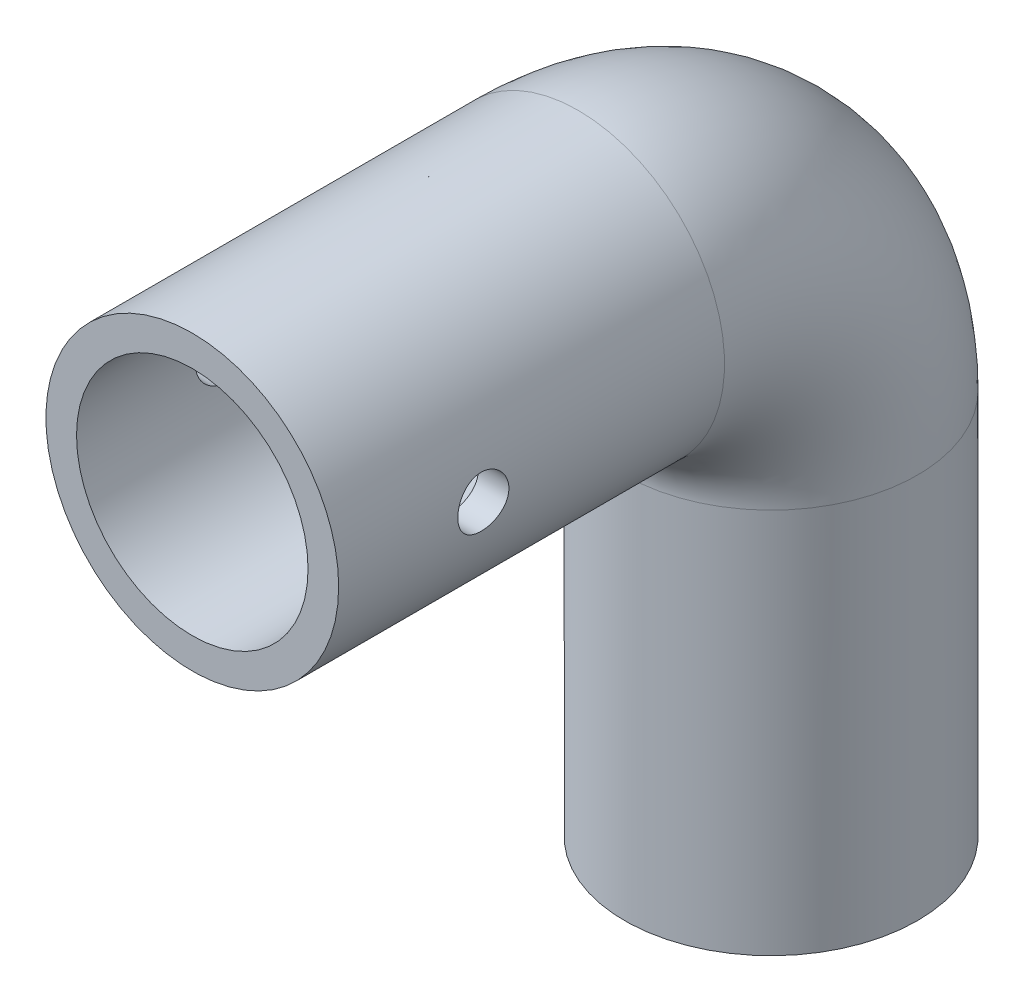
ISO-10303-21;
HEADER;
FILE_DESCRIPTION(('STEP AP214'),'2;1');
FILE_NAME('part.step','',(''),(''),'','','');
FILE_SCHEMA(('AUTOMOTIVE_DESIGN { 1 0 10303 214 1 1 1 1 }'));
ENDSEC;
DATA;
#1=APPLICATION_CONTEXT('core data for automotive mechanical design processes');
#2=APPLICATION_PROTOCOL_DEFINITION('international standard','automotive_design',2000,#1);
#3=PRODUCT_CONTEXT('',#1,'mechanical');
#4=PRODUCT('Part','Part','',(#3));
#5=PRODUCT_RELATED_PRODUCT_CATEGORY('part','',(#4));
#6=PRODUCT_DEFINITION_FORMATION('','',#4);
#7=PRODUCT_DEFINITION_CONTEXT('part definition',#1,'design');
#8=PRODUCT_DEFINITION('design','',#6,#7);
#9=PRODUCT_DEFINITION_SHAPE('','',#8);
#10=(LENGTH_UNIT() NAMED_UNIT(*) SI_UNIT(.MILLI.,.METRE.));
#11=(NAMED_UNIT(*) PLANE_ANGLE_UNIT() SI_UNIT($,.RADIAN.));
#12=(NAMED_UNIT(*) SI_UNIT($,.STERADIAN.) SOLID_ANGLE_UNIT());
#13=UNCERTAINTY_MEASURE_WITH_UNIT(LENGTH_MEASURE(1.E-05),#10,'distance_accuracy_value','');
#14=(GEOMETRIC_REPRESENTATION_CONTEXT(3) GLOBAL_UNCERTAINTY_ASSIGNED_CONTEXT((#13)) GLOBAL_UNIT_ASSIGNED_CONTEXT((#10,
#11,#12)) REPRESENTATION_CONTEXT('',''));
#15=CARTESIAN_POINT('',(0.,0.,0.));
#16=DIRECTION('',(0.,0.,1.));
#17=DIRECTION('',(1.,0.,0.));
#18=AXIS2_PLACEMENT_3D('',#15,#16,#17);
#19=CARTESIAN_POINT('',(0.,0.,0.));
#20=DIRECTION('',(0.,0.,-1.));
#21=DIRECTION('',(-1.,0.,0.));
#22=AXIS2_PLACEMENT_3D('',#19,#20,#21);
#23=CYLINDRICAL_SURFACE('',#22,15.175);
#24=CARTESIAN_POINT('',(-15.175,0.,-17.65));
#25=CARTESIAN_POINT('',(-15.1749974064039,0.147648243844478,-17.6499941766016));
#26=CARTESIAN_POINT('',(-15.1728227661229,0.2953744315329,-17.6376186837428));
#27=CARTESIAN_POINT('',(-15.1643571715427,0.586676318693331,-17.58846843069));
#28=CARTESIAN_POINT('',(-15.1580625468,0.730248197936956,-17.5516719136973));
#29=CARTESIAN_POINT('',(-15.1420623123558,1.00898540411133,-17.4548305083773));
#30=CARTESIAN_POINT('',(-15.1323596012453,1.1441577602516,-17.3948053716848));
#31=CARTESIAN_POINT('',(-15.1106073289541,1.40249715445609,-17.2532639849897));
#32=CARTESIAN_POINT('',(-15.0985580070589,1.52566541466684,-17.1717499259286));
#33=CARTESIAN_POINT('',(-15.073305284455,1.7578033444615,-16.9886388513783));
#34=CARTESIAN_POINT('',(-15.0600921378452,1.86662933589699,-16.8868610136287));
#35=CARTESIAN_POINT('',(-15.0340747214544,2.06575175740715,-16.6665006253358));
#36=CARTESIAN_POINT('',(-15.021270478798,2.15604696039513,-16.5479169628093));
#37=CARTESIAN_POINT('',(-14.9974261395803,2.31612856856196,-16.296313515786));
#38=CARTESIAN_POINT('',(-14.9863986276067,2.38577137986726,-16.1632010732754));
#39=CARTESIAN_POINT('',(-14.9674923713733,2.50165269116626,-15.8869418365056));
#40=CARTESIAN_POINT('',(-14.959613392944,2.54789293177329,-15.7437957894179));
#41=CARTESIAN_POINT('',(-14.9479937381197,2.61520067315822,-15.4530612262915));
#42=CARTESIAN_POINT('',(-14.9442121540137,2.63651718140411,-15.3055320241791));
#43=CARTESIAN_POINT('',(-14.9410918699985,2.65414472958903,-15.0089461850617));
#44=CARTESIAN_POINT('',(-14.9417528248761,2.65045771245853,-14.8598896676374));
#45=CARTESIAN_POINT('',(-14.9474056272389,2.61838535739447,-14.5662676085279));
#46=CARTESIAN_POINT('',(-14.9523482028749,2.59028099755878,-14.4216702881913));
#47=CARTESIAN_POINT('',(-14.9659301203762,2.5106132582377,-14.1392752335586));
#48=CARTESIAN_POINT('',(-14.9745696002876,2.45904900273164,-14.0014777533898));
#49=CARTESIAN_POINT('',(-14.9946244679725,2.33364405992106,-13.7357598164403));
#50=CARTESIAN_POINT('',(-15.0060541855088,2.25968788814212,-13.6078949883433));
#51=CARTESIAN_POINT('',(-15.0303919199376,2.09168032934689,-13.3662836956274));
#52=CARTESIAN_POINT('',(-15.0433000674734,1.99762716579763,-13.2525384805596));
#53=CARTESIAN_POINT('',(-15.069356080034,1.79057043317531,-13.0407698803997));
#54=CARTESIAN_POINT('',(-15.0825048144791,1.67732605857837,-12.9429818971667));
#55=CARTESIAN_POINT('',(-15.1073982055927,1.43591271250156,-12.7677589180498));
#56=CARTESIAN_POINT('',(-15.1191428514944,1.30774362659296,-12.6903240782296));
#57=CARTESIAN_POINT('',(-15.1399239172846,1.03988885242209,-12.5579791974993));
#58=CARTESIAN_POINT('',(-15.1489576712667,0.900191998651237,-12.5030913099547));
#59=CARTESIAN_POINT('',(-15.1632780202203,0.613369163320422,-12.4176240347171));
#60=CARTESIAN_POINT('',(-15.1685649597426,0.466243866201081,-12.387042411829));
#61=CARTESIAN_POINT('',(-15.1747492875093,0.170768059957225,-12.3513780266997));
#62=CARTESIAN_POINT('',(-15.1757022626835,0.0224576523055133,-12.34597233899));
#63=CARTESIAN_POINT('',(-15.1732640150868,-0.272948911422718,-12.359950392095));
#64=CARTESIAN_POINT('',(-15.1698729764326,-0.420045118695999,-12.3793330822782));
#65=CARTESIAN_POINT('',(-15.1591622039047,-0.707840405361593,-12.4420691174099));
#66=CARTESIAN_POINT('',(-15.1518688958912,-0.848575688189006,-12.4852612853293));
#67=CARTESIAN_POINT('',(-15.1341679808123,-1.1208075424358,-12.5942174321889));
#68=CARTESIAN_POINT('',(-15.1237601849362,-1.25230355314214,-12.6599827796275));
#69=CARTESIAN_POINT('',(-15.1008464771594,-1.50371784874993,-12.8129488506752));
#70=CARTESIAN_POINT('',(-15.0883213467356,-1.62351260283844,-12.9003496733286));
#71=CARTESIAN_POINT('',(-15.0626169389685,-1.84685056306635,-13.0938321209533));
#72=CARTESIAN_POINT('',(-15.0494376092101,-1.95039246423561,-13.1999152445099));
#73=CARTESIAN_POINT('',(-15.0237287153678,-2.13949371183536,-13.4292044770167));
#74=CARTESIAN_POINT('',(-15.011208297492,-2.22483404234861,-13.5525924049802));
#75=CARTESIAN_POINT('',(-14.9884104086226,-2.3735762816681,-13.8121424295855));
#76=CARTESIAN_POINT('',(-14.9781328616795,-2.43697893338481,-13.9483040934514));
#77=CARTESIAN_POINT('',(-14.9610541786933,-2.53972471940061,-14.2289449050297));
#78=CARTESIAN_POINT('',(-14.9542377741183,-2.57917367707349,-14.3733843378983));
#79=CARTESIAN_POINT('',(-14.9448160737523,-2.63322299429685,-14.6669694037372));
#80=CARTESIAN_POINT('',(-14.9422103722277,-2.647825747977,-14.8161145818607));
#81=CARTESIAN_POINT('',(-14.9415237489158,-2.65169640615764,-15.1126880481571));
#82=CARTESIAN_POINT('',(-14.943381212065,-2.64130929920643,-15.2601118035601));
#83=CARTESIAN_POINT('',(-14.9512760064122,-2.59624450353386,-15.5510787803424));
#84=CARTESIAN_POINT('',(-14.9573133200989,-2.56156691657599,-15.6946220179763));
#85=CARTESIAN_POINT('',(-14.9728632028595,-2.46904272437462,-15.9736005914648));
#86=CARTESIAN_POINT('',(-14.9823708893835,-2.4112286594292,-16.1090470088625));
#87=CARTESIAN_POINT('',(-15.0037944611049,-2.2741088522703,-16.3683735048738));
#88=CARTESIAN_POINT('',(-15.0157104847189,-2.19480187468397,-16.492252918087));
#89=CARTESIAN_POINT('',(-15.0408019466779,-2.01572793006059,-16.7266665275475));
#90=CARTESIAN_POINT('',(-15.0539917565902,-1.91570813445559,-16.8370060737835));
#91=CARTESIAN_POINT('',(-15.0800326762498,-1.69857899715446,-17.0394521719192));
#92=CARTESIAN_POINT('',(-15.0928837073212,-1.58146572634864,-17.1315545203113));
#93=CARTESIAN_POINT('',(-15.1169137634344,-1.33240411753729,-17.2955623631435));
#94=CARTESIAN_POINT('',(-15.128079226934,-1.20034901506857,-17.3673077462842));
#95=CARTESIAN_POINT('',(-15.1473481252041,-0.925915032353569,-17.4874838317986));
#96=CARTESIAN_POINT('',(-15.1554545443977,-0.783546376596997,-17.5359372706497));
#97=CARTESIAN_POINT('',(-15.165965546675,-0.533893508538533,-17.5978856790505));
#98=CARTESIAN_POINT('',(-15.1693349842757,-0.428101844795429,-17.6173964881246));
#99=CARTESIAN_POINT('',(-15.1738531325651,-0.214887195826175,-17.6434556380678));
#100=CARTESIAN_POINT('',(-15.175001887722,-0.107464243309344,-17.6500042385001));
#101=CARTESIAN_POINT('',(-15.175,0.,-17.65));
#102=B_SPLINE_CURVE_WITH_KNOTS('',3,(#24,#25,#26,#27,#28,#29,#30,#31,#32,#33,#34,#35,#36,#37,
#38,#39,#40,#41,#42,#43,#44,#45,#46,#47,#48,#49,#50,#51,#52,#53,#54,#55,#56,#57,#58,#59,#60,#61,
#62,#63,#64,#65,#66,#67,#68,#69,#70,#71,#72,#73,#74,#75,#76,#77,#78,#79,#80,#81,#82,#83,#84,#85,
#86,#87,#88,#89,#90,#91,#92,#93,#94,#95,#96,#97,#98,#99,#100,#101),.UNSPECIFIED.,.T.,.F.,(4,2,2,
2,2,2,2,2,2,2,2,2,2,2,2,2,2,2,2,2,2,2,2,2,2,2,2,2,2,2,2,2,2,2,2,2,2,2,4),(0.,0.442551849632869,
0.885498500881895,1.32806933280104,1.77059505906007,2.21726252093644,2.66395955106177,
3.11369327427877,3.56339354272665,4.00856149002922,4.4536948453915,4.89377275456771,
5.33386709813041,5.77627101464181,6.2187140549453,6.66718717273105,7.1156637292162,
7.56457988555955,8.01345475495685,8.45655586387527,8.89963819300496,9.33975729147715,
9.77990307687219,10.2242825615179,10.6686977079431,11.1181913859245,11.5676698404974,
12.0151478471178,12.4625827332253,12.9038762427145,13.3451679034426,13.7858410786367,
14.2265395882838,14.6729732052611,15.1195096016409,15.5694664510616,16.018983177778,
16.3410964029433,16.6632031778538),.UNSPECIFIED.);
#103=CARTESIAN_POINT('',(-15.175,0.,-17.65));
#104=VERTEX_POINT('',#103);
#105=EDGE_CURVE('E10',#104,#104,#102,.T.);
#106=ORIENTED_EDGE('',*,*,#105,.T.);
#107=EDGE_LOOP('',(#106));
#108=FACE_BOUND('',#107,.T.);
#109=CARTESIAN_POINT('',(15.175,0.,-12.35));
#110=CARTESIAN_POINT('',(15.1749974064039,0.147648243844478,-12.3500058233984));
#111=CARTESIAN_POINT('',(15.1728227661229,0.2953744315329,-12.3623813162572));
#112=CARTESIAN_POINT('',(15.1643571715427,0.586676318693332,-12.41153156931));
#113=CARTESIAN_POINT('',(15.1580625468,0.730248197936956,-12.4483280863027));
#114=CARTESIAN_POINT('',(15.1420623123558,1.00898540411133,-12.5451694916227));
#115=CARTESIAN_POINT('',(15.1323596012453,1.1441577602516,-12.6051946283152));
#116=CARTESIAN_POINT('',(15.1106073289541,1.40249715445609,-12.7467360150103));
#117=CARTESIAN_POINT('',(15.0985580070589,1.52566541466684,-12.8282500740714));
#118=CARTESIAN_POINT('',(15.073305284455,1.7578033444615,-13.0113611486217));
#119=CARTESIAN_POINT('',(15.0600921378452,1.86662933589699,-13.1131389863713));
#120=CARTESIAN_POINT('',(15.0340747214544,2.06575175740715,-13.3334993746642));
#121=CARTESIAN_POINT('',(15.021270478798,2.15604696039513,-13.4520830371907));
#122=CARTESIAN_POINT('',(14.9974261395803,2.31612856856196,-13.703686484214));
#123=CARTESIAN_POINT('',(14.9863986276067,2.38577137986726,-13.8367989267246));
#124=CARTESIAN_POINT('',(14.9674923713733,2.50165269116626,-14.1130581634944));
#125=CARTESIAN_POINT('',(14.959613392944,2.54789293177329,-14.2562042105821));
#126=CARTESIAN_POINT('',(14.9479937381197,2.61520067315822,-14.5469387737085));
#127=CARTESIAN_POINT('',(14.9442121540137,2.63651718140411,-14.6944679758209));
#128=CARTESIAN_POINT('',(14.9410918699985,2.65414472958903,-14.9910538149383));
#129=CARTESIAN_POINT('',(14.9417528248761,2.65045771245853,-15.1401103323626));
#130=CARTESIAN_POINT('',(14.9474056272389,2.61838535739447,-15.4337323914721));
#131=CARTESIAN_POINT('',(14.9523482028749,2.59028099755878,-15.5783297118087));
#132=CARTESIAN_POINT('',(14.9659301203762,2.5106132582377,-15.8607247664414));
#133=CARTESIAN_POINT('',(14.9745696002876,2.45904900273164,-15.9985222466102));
#134=CARTESIAN_POINT('',(14.9946244679725,2.33364405992106,-16.2642401835597));
#135=CARTESIAN_POINT('',(15.0060541855088,2.25968788814212,-16.3921050116567));
#136=CARTESIAN_POINT('',(15.0303919199376,2.09168032934689,-16.6337163043726));
#137=CARTESIAN_POINT('',(15.0433000674734,1.99762716579763,-16.7474615194404));
#138=CARTESIAN_POINT('',(15.069356080034,1.79057043317531,-16.9592301196003));
#139=CARTESIAN_POINT('',(15.0825048144791,1.67732605857837,-17.0570181028333));
#140=CARTESIAN_POINT('',(15.1073982055927,1.43591271250156,-17.2322410819502));
#141=CARTESIAN_POINT('',(15.1191428514944,1.30774362659296,-17.3096759217704));
#142=CARTESIAN_POINT('',(15.1399239172846,1.0398888524221,-17.4420208025007));
#143=CARTESIAN_POINT('',(15.1489576712667,0.900191998651237,-17.4969086900453));
#144=CARTESIAN_POINT('',(15.1632780202203,0.613369163320422,-17.5823759652828));
#145=CARTESIAN_POINT('',(15.1685649597426,0.466243866201081,-17.612957588171));
#146=CARTESIAN_POINT('',(15.1747492875093,0.170768059957225,-17.6486219733003));
#147=CARTESIAN_POINT('',(15.1757022626835,0.0224576523055125,-17.65402766101));
#148=CARTESIAN_POINT('',(15.1732640150868,-0.272948911422719,-17.640049607905));
#149=CARTESIAN_POINT('',(15.1698729764326,-0.420045118696001,-17.6206669177218));
#150=CARTESIAN_POINT('',(15.1591622039047,-0.707840405361594,-17.5579308825901));
#151=CARTESIAN_POINT('',(15.1518688958912,-0.848575688189007,-17.5147387146707));
#152=CARTESIAN_POINT('',(15.1341679808123,-1.1208075424358,-17.4057825678111));
#153=CARTESIAN_POINT('',(15.1237601849362,-1.25230355314214,-17.3400172203725));
#154=CARTESIAN_POINT('',(15.1008464771594,-1.50371784874993,-17.1870511493248));
#155=CARTESIAN_POINT('',(15.0883213467356,-1.62351260283844,-17.0996503266714));
#156=CARTESIAN_POINT('',(15.0626169389685,-1.84685056306635,-16.9061678790467));
#157=CARTESIAN_POINT('',(15.0494376092101,-1.95039246423561,-16.8000847554901));
#158=CARTESIAN_POINT('',(15.0237287153678,-2.13949371183536,-16.5707955229833));
#159=CARTESIAN_POINT('',(15.011208297492,-2.22483404234861,-16.4474075950198));
#160=CARTESIAN_POINT('',(14.9884104086226,-2.3735762816681,-16.1878575704145));
#161=CARTESIAN_POINT('',(14.9781328616795,-2.43697893338481,-16.0516959065486));
#162=CARTESIAN_POINT('',(14.9610541786933,-2.53972471940061,-15.7710550949703));
#163=CARTESIAN_POINT('',(14.9542377741183,-2.57917367707349,-15.6266156621017));
#164=CARTESIAN_POINT('',(14.9448160737523,-2.63322299429685,-15.3330305962628));
#165=CARTESIAN_POINT('',(14.9422103722277,-2.647825747977,-15.1838854181393));
#166=CARTESIAN_POINT('',(14.9415237489158,-2.65169640615764,-14.8873119518429));
#167=CARTESIAN_POINT('',(14.943381212065,-2.64130929920643,-14.7398881964399));
#168=CARTESIAN_POINT('',(14.9512760064122,-2.59624450353386,-14.4489212196576));
#169=CARTESIAN_POINT('',(14.9573133200989,-2.56156691657599,-14.3053779820237));
#170=CARTESIAN_POINT('',(14.9728632028595,-2.46904272437462,-14.0263994085352));
#171=CARTESIAN_POINT('',(14.9823708893835,-2.4112286594292,-13.8909529911375));
#172=CARTESIAN_POINT('',(15.0037944611049,-2.2741088522703,-13.6316264951262));
#173=CARTESIAN_POINT('',(15.0157104847189,-2.19480187468396,-13.507747081913));
#174=CARTESIAN_POINT('',(15.0408019466779,-2.01572793006058,-13.2733334724525));
#175=CARTESIAN_POINT('',(15.0539917565902,-1.91570813445559,-13.1629939262165));
#176=CARTESIAN_POINT('',(15.0800326762498,-1.69857899715446,-12.9605478280808));
#177=CARTESIAN_POINT('',(15.0928837073212,-1.58146572634864,-12.8684454796887));
#178=CARTESIAN_POINT('',(15.1169137634344,-1.33240411753728,-12.7044376368565));
#179=CARTESIAN_POINT('',(15.128079226934,-1.20034901506857,-12.6326922537158));
#180=CARTESIAN_POINT('',(15.1473481252041,-0.925915032353567,-12.5125161682014));
#181=CARTESIAN_POINT('',(15.1554545443977,-0.783546376596995,-12.4640627293503));
#182=CARTESIAN_POINT('',(15.165965546675,-0.533893508538533,-12.4021143209495));
#183=CARTESIAN_POINT('',(15.1693349842757,-0.428101844795429,-12.3826035118754));
#184=CARTESIAN_POINT('',(15.1738531325651,-0.214887195826176,-12.3565443619322));
#185=CARTESIAN_POINT('',(15.175001887722,-0.107464243309344,-12.3499957614999));
#186=CARTESIAN_POINT('',(15.175,0.,-12.35));
#187=B_SPLINE_CURVE_WITH_KNOTS('',3,(#109,#110,#111,#112,#113,#114,#115,#116,#117,#118,#119,
#120,#121,#122,#123,#124,#125,#126,#127,#128,#129,#130,#131,#132,#133,#134,#135,#136,#137,#138,
#139,#140,#141,#142,#143,#144,#145,#146,#147,#148,#149,#150,#151,#152,#153,#154,#155,#156,#157,
#158,#159,#160,#161,#162,#163,#164,#165,#166,#167,#168,#169,#170,#171,#172,#173,#174,#175,#176,
#177,#178,#179,#180,#181,#182,#183,#184,#185,#186),.UNSPECIFIED.,.T.,.F.,(4,2,2,2,2,2,2,2,2,2,2,
2,2,2,2,2,2,2,2,2,2,2,2,2,2,2,2,2,2,2,2,2,2,2,2,2,2,2,4),(0.,0.442551849632869,
0.885498500881895,1.32806933280104,1.77059505906007,2.21726252093644,2.66395955106177,
3.11369327427877,3.56339354272665,4.00856149002922,4.4536948453915,4.89377275456771,
5.33386709813041,5.77627101464182,6.21871405494531,6.66718717273105,7.1156637292162,
7.56457988555955,8.01345475495685,8.45655586387527,8.89963819300496,9.33975729147715,
9.77990307687219,10.2242825615179,10.6686977079431,11.1181913859245,11.5676698404974,
12.0151478471178,12.4625827332253,12.9038762427145,13.3451679034426,13.7858410786367,
14.2265395882838,14.6729732052611,15.1195096016409,15.5694664510616,16.018983177778,
16.3410964029433,16.6632031778538),.UNSPECIFIED.);
#188=CARTESIAN_POINT('',(15.175,0.,-12.35));
#189=VERTEX_POINT('',#188);
#190=EDGE_CURVE('E49',#189,#189,#187,.T.);
#191=ORIENTED_EDGE('',*,*,#190,.T.);
#192=EDGE_LOOP('',(#191));
#193=FACE_BOUND('',#192,.T.);
#194=CARTESIAN_POINT('',(0.,0.,-40.));
#195=DIRECTION('',(0.,0.,1.));
#196=DIRECTION('',(1.,0.,0.));
#197=AXIS2_PLACEMENT_3D('',#194,#195,#196);
#198=CIRCLE('',#197,15.175);
#199=CARTESIAN_POINT('',(0.,15.175,-40.));
#200=VERTEX_POINT('',#199);
#201=EDGE_CURVE('E93',#200,#200,#198,.T.);
#202=ORIENTED_EDGE('',*,*,#201,.T.);
#203=EDGE_LOOP('',(#202));
#204=FACE_BOUND('',#203,.T.);
#205=CARTESIAN_POINT('',(0.,0.,0.));
#206=DIRECTION('',(0.,0.,1.));
#207=DIRECTION('',(1.,0.,0.));
#208=AXIS2_PLACEMENT_3D('',#205,#206,#207);
#209=CIRCLE('',#208,15.175);
#210=CARTESIAN_POINT('',(15.175,0.,0.));
#211=VERTEX_POINT('',#210);
#212=EDGE_CURVE('E113',#211,#211,#209,.T.);
#213=ORIENTED_EDGE('',*,*,#212,.F.);
#214=EDGE_LOOP('',(#213));
#215=FACE_BOUND('',#214,.T.);
#216=ADVANCED_FACE('F36',(#108,#193,#204,#215),#23,.T.);
#217=CARTESIAN_POINT('',(0.,-20.,-40.));
#218=DIRECTION('',(-1.,0.,0.));
#219=DIRECTION('',(0.,0.,1.));
#220=AXIS2_PLACEMENT_3D('',#217,#218,#219);
#221=TOROIDAL_SURFACE('',#220,20.,15.175);
#222=CARTESIAN_POINT('',(0.,-20.,-60.));
#223=DIRECTION('',(0.,1.,0.));
#224=DIRECTION('',(1.,0.,0.));
#225=AXIS2_PLACEMENT_3D('',#222,#223,#224);
#226=CIRCLE('',#225,15.175);
#227=CARTESIAN_POINT('',(0.,-20.,-75.175));
#228=VERTEX_POINT('',#227);
#229=EDGE_CURVE('E68',#228,#228,#226,.T.);
#230=CARTESIAN_POINT('',(0.,-20.,-40.));
#231=DIRECTION('',(-1.,0.,0.));
#232=DIRECTION('',(0.,0.,1.));
#233=AXIS2_PLACEMENT_3D('',#230,#231,#232);
#234=CIRCLE('',#233,35.175);
#235=EDGE_CURVE('',#200,#228,#234,.T.);
#236=ORIENTED_EDGE('',*,*,#201,.F.);
#237=ORIENTED_EDGE('',*,*,#229,.T.);
#238=ORIENTED_EDGE('',*,*,#235,.T.);
#239=ORIENTED_EDGE('',*,*,#235,.F.);
#240=EDGE_LOOP('',(#236,#238,#237,#239));
#241=FACE_BOUND('',#240,.T.);
#242=ADVANCED_FACE('F126',(#241),#221,.T.);
#243=CARTESIAN_POINT('',(0.,-20.,-60.));
#244=DIRECTION('',(0.,-1.,0.));
#245=DIRECTION('',(0.,0.,-1.));
#246=AXIS2_PLACEMENT_3D('',#243,#244,#245);
#247=CYLINDRICAL_SURFACE('',#246,15.175);
#248=CARTESIAN_POINT('',(0.,-60.,-60.));
#249=DIRECTION('',(0.,1.,0.));
#250=DIRECTION('',(1.,0.,0.));
#251=AXIS2_PLACEMENT_3D('',#248,#249,#250);
#252=CIRCLE('',#251,15.175);
#253=CARTESIAN_POINT('',(15.175,-60.,-60.));
#254=VERTEX_POINT('',#253);
#255=EDGE_CURVE('E103',#254,#254,#252,.T.);
#256=ORIENTED_EDGE('',*,*,#255,.T.);
#257=EDGE_LOOP('',(#256));
#258=FACE_BOUND('',#257,.T.);
#259=ORIENTED_EDGE('',*,*,#229,.F.);
#260=EDGE_LOOP('',(#259));
#261=FACE_BOUND('',#260,.T.);
#262=ADVANCED_FACE('F38',(#258,#261),#247,.T.);
#263=CARTESIAN_POINT('',(0.,0.,0.));
#264=DIRECTION('',(0.,0.,1.));
#265=DIRECTION('',(1.,0.,0.));
#266=AXIS2_PLACEMENT_3D('',#263,#264,#265);
#267=PLANE('',#266);
#268=CARTESIAN_POINT('',(0.,0.,0.));
#269=DIRECTION('',(0.,0.,1.));
#270=DIRECTION('',(1.,0.,0.));
#271=AXIS2_PLACEMENT_3D('',#268,#269,#270);
#272=CIRCLE('',#271,12.);
#273=CARTESIAN_POINT('',(12.,0.,0.));
#274=VERTEX_POINT('',#273);
#275=EDGE_CURVE('E98',#274,#274,#272,.F.);
#276=ORIENTED_EDGE('',*,*,#275,.T.);
#277=EDGE_LOOP('',(#276));
#278=FACE_BOUND('',#277,.T.);
#279=ORIENTED_EDGE('',*,*,#212,.T.);
#280=EDGE_LOOP('',(#279));
#281=FACE_BOUND('',#280,.T.);
#282=ADVANCED_FACE('F130',(#278,#281),#267,.T.);
#283=CARTESIAN_POINT('',(0.,-60.,-60.));
#284=DIRECTION('',(0.,1.,0.));
#285=DIRECTION('',(1.,0.,0.));
#286=AXIS2_PLACEMENT_3D('',#283,#284,#285);
#287=PLANE('',#286);
#288=CARTESIAN_POINT('',(0.,-60.,-60.));
#289=DIRECTION('',(0.,1.,0.));
#290=DIRECTION('',(1.,0.,0.));
#291=AXIS2_PLACEMENT_3D('',#288,#289,#290);
#292=CIRCLE('',#291,12.);
#293=CARTESIAN_POINT('',(12.,-60.,-60.));
#294=VERTEX_POINT('',#293);
#295=EDGE_CURVE('E55',#294,#294,#292,.F.);
#296=ORIENTED_EDGE('',*,*,#295,.F.);
#297=EDGE_LOOP('',(#296));
#298=FACE_BOUND('',#297,.T.);
#299=ORIENTED_EDGE('',*,*,#255,.F.);
#300=EDGE_LOOP('',(#299));
#301=FACE_BOUND('',#300,.T.);
#302=ADVANCED_FACE('F136',(#298,#301),#287,.F.);
#303=CARTESIAN_POINT('',(0.,0.,0.));
#304=DIRECTION('',(0.,0.,-1.));
#305=DIRECTION('',(-1.,0.,0.));
#306=AXIS2_PLACEMENT_3D('',#303,#304,#305);
#307=CYLINDRICAL_SURFACE('',#306,12.);
#308=CARTESIAN_POINT('',(-12.,0.,-12.35));
#309=CARTESIAN_POINT('',(-11.9999972951489,0.146940308290936,-12.3500049682627));
#310=CARTESIAN_POINT('',(-11.9972736759589,0.293940344171115,-12.3622628314451));
#311=CARTESIAN_POINT('',(-11.9866717402058,0.583762532888666,-12.4109180885449));
#312=CARTESIAN_POINT('',(-11.9787897887227,0.726581665372567,-12.4473325050981));
#313=CARTESIAN_POINT('',(-11.9587484793764,1.00381183478239,-12.5431028068599));
#314=CARTESIAN_POINT('',(-11.946593633913,1.13823156622647,-12.602434496731));
#315=CARTESIAN_POINT('',(-11.9193172757498,1.39520413491741,-12.7422778056173));
#316=CARTESIAN_POINT('',(-11.9041958282943,1.51775723305753,-12.8227889588478));
#317=CARTESIAN_POINT('',(-11.8723656159311,1.74952440930501,-13.0040976701591));
#318=CARTESIAN_POINT('',(-11.8556368483986,1.85851685943942,-13.1051750478558));
#319=CARTESIAN_POINT('',(-11.8226178489871,2.05814683548646,-13.3241463749929));
#320=CARTESIAN_POINT('',(-11.806327656931,2.14878269944939,-13.442041845447));
#321=CARTESIAN_POINT('',(-11.775832757534,2.31010859450532,-13.6929466150919));
#322=CARTESIAN_POINT('',(-11.7616536669775,2.38056192693113,-13.8261114978463));
#323=CARTESIAN_POINT('',(-11.7372737888705,2.49800430240879,-14.1027555880969));
#324=CARTESIAN_POINT('',(-11.7270725157671,2.54499620948027,-14.2462335341932));
#325=CARTESIAN_POINT('',(-11.7120071352705,2.6134478422027,-14.5370246384376));
#326=CARTESIAN_POINT('',(-11.7070610141935,2.63530036309206,-14.6842409930183));
#327=CARTESIAN_POINT('',(-11.7028196927701,2.65407439902488,-14.980327006011));
#328=CARTESIAN_POINT('',(-11.7035237838984,2.65099903997474,-15.1291964547903));
#329=CARTESIAN_POINT('',(-11.7104291170523,2.6203205407664,-15.4214370569619));
#330=CARTESIAN_POINT('',(-11.7165279240342,2.59317443345232,-15.5648589761577));
#331=CARTESIAN_POINT('',(-11.7333734701739,2.51584941080599,-15.8450613617452));
#332=CARTESIAN_POINT('',(-11.7441204746192,2.46566918083176,-15.9818414485704));
#333=CARTESIAN_POINT('',(-11.7691519983642,2.3432826316753,-16.2461585261499));
#334=CARTESIAN_POINT('',(-11.7834644640378,2.27090120854052,-16.3736116818116));
#335=CARTESIAN_POINT('',(-11.8139972041102,2.10628999407423,-16.6147318689652));
#336=CARTESIAN_POINT('',(-11.8302177431856,2.01405744763715,-16.7283969834097));
#337=CARTESIAN_POINT('',(-11.863177976232,1.80994612230801,-16.9413450919108));
#338=CARTESIAN_POINT('',(-11.8799212299093,1.69767889303313,-17.0402555781051));
#339=CARTESIAN_POINT('',(-11.9117147551245,1.4579600533844,-17.2179063304958));
#340=CARTESIAN_POINT('',(-11.9267649948297,1.33050815759561,-17.2966462174728));
#341=CARTESIAN_POINT('',(-11.9535270849056,1.06357834313975,-17.4318154684979));
#342=CARTESIAN_POINT('',(-11.9652315050415,0.924074540532676,-17.4881952822151));
#343=CARTESIAN_POINT('',(-11.9839280552212,0.637257060526545,-17.5766091201146));
#344=CARTESIAN_POINT('',(-11.9909208840591,0.489944544765018,-17.6086467546684));
#345=CARTESIAN_POINT('',(-11.9993066334821,0.194885893678652,-17.6469232832804));
#346=CARTESIAN_POINT('',(-12.0008099672854,0.0472088052159419,-17.6536709232557));
#347=CARTESIAN_POINT('',(-11.9983570704866,-0.247162533790257,-17.6425558946607));
#348=CARTESIAN_POINT('',(-11.994401217734,-0.393856851648625,-17.6246949293386));
#349=CARTESIAN_POINT('',(-11.9815441844115,-0.680407680977622,-17.5652914207541));
#350=CARTESIAN_POINT('',(-11.9726988973439,-0.820322381323723,-17.5240163976107));
#351=CARTESIAN_POINT('',(-11.9510533429512,-1.09124209612844,-17.4192539014336));
#352=CARTESIAN_POINT('',(-11.9382527342399,-1.22224634032908,-17.3557645110023));
#353=CARTESIAN_POINT('',(-11.9098445062245,-1.47372507086373,-17.2073202565738));
#354=CARTESIAN_POINT('',(-11.8941988655601,-1.59401926715001,-17.1220674029523));
#355=CARTESIAN_POINT('',(-11.8619124454699,-1.81877656458279,-16.9329078882606));
#356=CARTESIAN_POINT('',(-11.8452715343179,-1.92323756367689,-16.8289987543322));
#357=CARTESIAN_POINT('',(-11.8124876917645,-2.11538008567856,-16.6031397859692));
#358=CARTESIAN_POINT('',(-11.7963600165735,-2.20270900106231,-16.4808873532182));
#359=CARTESIAN_POINT('',(-11.7667856569015,-2.35559835865337,-16.2231529598473));
#360=CARTESIAN_POINT('',(-11.7533388557175,-2.42115974851945,-16.0876715754879));
#361=CARTESIAN_POINT('',(-11.7307786953899,-2.52820614115396,-15.8080546903068));
#362=CARTESIAN_POINT('',(-11.7216408591963,-2.56982743976436,-15.6639734406221));
#363=CARTESIAN_POINT('',(-11.7086901756487,-2.62820946584912,-15.3706338909352));
#364=CARTESIAN_POINT('',(-11.7048764577705,-2.64497425753465,-15.221376441363));
#365=CARTESIAN_POINT('',(-11.7030614200183,-2.65299181593562,-14.925478537624));
#366=CARTESIAN_POINT('',(-11.7049326654257,-2.64480391194395,-14.7788537448584));
#367=CARTESIAN_POINT('',(-11.7139881000787,-2.60440081263548,-14.4891286600773));
#368=CARTESIAN_POINT('',(-11.7211722241895,-2.57218591188368,-14.3460283248751));
#369=CARTESIAN_POINT('',(-11.7399812381898,-2.48491586462711,-14.0678689465891));
#370=CARTESIAN_POINT('',(-11.7515899978881,-2.429943618982,-13.9327827309118));
#371=CARTESIAN_POINT('',(-11.7779462984195,-2.29879000639516,-13.6736679586568));
#372=CARTESIAN_POINT('',(-11.7926941734866,-2.22260638072854,-13.5496405815539));
#373=CARTESIAN_POINT('',(-11.8240465694056,-2.04934387877037,-13.3134102837916));
#374=CARTESIAN_POINT('',(-11.8406830683776,-1.95186703708089,-13.201503438553));
#375=CARTESIAN_POINT('',(-11.8737249404744,-1.73958969152694,-12.9954520939301));
#376=CARTESIAN_POINT('',(-11.8901302592208,-1.62478518382682,-12.9013117111156));
#377=CARTESIAN_POINT('',(-11.9211198560816,-1.37927376480152,-12.7322671298156));
#378=CARTESIAN_POINT('',(-11.9356770573328,-1.24837591499715,-12.6576349925008));
#379=CARTESIAN_POINT('',(-11.9610578141595,-0.975598591762584,-12.5315503733009));
#380=CARTESIAN_POINT('',(-11.9718844709349,-0.833728360398489,-12.4800786272516));
#381=CARTESIAN_POINT('',(-11.986673174862,-0.576449469998816,-12.4108535845124));
#382=CARTESIAN_POINT('',(-11.9916395713802,-0.462423242138272,-12.3880773834798));
#383=CARTESIAN_POINT('',(-11.9983039779518,-0.23227705312646,-12.3576489750081));
#384=CARTESIAN_POINT('',(-12.0000021382009,-0.116157188438387,-12.3499960725588));
#385=CARTESIAN_POINT('',(-12.,0.,-12.35));
#386=B_SPLINE_CURVE_WITH_KNOTS('',3,(#308,#309,#310,#311,#312,#313,#314,#315,#316,#317,#318,
#319,#320,#321,#322,#323,#324,#325,#326,#327,#328,#329,#330,#331,#332,#333,#334,#335,#336,#337,
#338,#339,#340,#341,#342,#343,#344,#345,#346,#347,#348,#349,#350,#351,#352,#353,#354,#355,#356,
#357,#358,#359,#360,#361,#362,#363,#364,#365,#366,#367,#368,#369,#370,#371,#372,#373,#374,#375,
#376,#377,#378,#379,#380,#381,#382,#383,#384,#385),.UNSPECIFIED.,.T.,.F.,(4,2,2,2,2,2,2,2,2,2,2,
2,2,2,2,2,2,2,2,2,2,2,2,2,2,2,2,2,2,2,2,2,2,2,2,2,2,2,4),(0.,0.440395712582129,
0.881102093269599,1.32134445619773,1.76157713800154,2.20825685379873,2.65497699256361,
3.10673973628008,3.55844731821933,4.00299692090779,4.44749077882591,4.88372152143444,
5.31997716442982,5.75976616872554,6.1996162500367,6.64916769813048,7.09872759744357,
7.54927823650209,7.99976203795474,8.44113349173688,8.88247439818116,9.31887144405196,
9.75530616613328,10.1980711688503,10.6408949026967,11.0920486982339,11.5431828500163,
11.9917225115493,12.440188825648,12.8786770113076,13.3171598212996,13.7540591810805,
14.1910050825356,14.636948440511,15.0829949990629,15.5349651009683,15.9865585687167,
16.3347100012904,16.6828454337585),.UNSPECIFIED.);
#387=CARTESIAN_POINT('',(-12.,0.,-12.35));
#388=VERTEX_POINT('',#387);
#389=EDGE_CURVE('E94',#388,#388,#386,.T.);
#390=ORIENTED_EDGE('',*,*,#389,.T.);
#391=EDGE_LOOP('',(#390));
#392=FACE_BOUND('',#391,.T.);
#393=CARTESIAN_POINT('',(12.,0.,-12.35));
#394=CARTESIAN_POINT('',(11.9999972951489,-0.146940308290936,-12.3500049682627));
#395=CARTESIAN_POINT('',(11.9972736759589,-0.293940344171115,-12.3622628314451));
#396=CARTESIAN_POINT('',(11.9866717402058,-0.583762532888666,-12.4109180885449));
#397=CARTESIAN_POINT('',(11.9787897887227,-0.726581665372567,-12.4473325050981));
#398=CARTESIAN_POINT('',(11.9587484793764,-1.00381183478239,-12.5431028068599));
#399=CARTESIAN_POINT('',(11.946593633913,-1.13823156622647,-12.602434496731));
#400=CARTESIAN_POINT('',(11.9193172757498,-1.39520413491741,-12.7422778056173));
#401=CARTESIAN_POINT('',(11.9041958282943,-1.51775723305753,-12.8227889588478));
#402=CARTESIAN_POINT('',(11.8723656159311,-1.74952440930501,-13.0040976701591));
#403=CARTESIAN_POINT('',(11.8556368483986,-1.85851685943942,-13.1051750478558));
#404=CARTESIAN_POINT('',(11.8226178489871,-2.05814683548646,-13.3241463749929));
#405=CARTESIAN_POINT('',(11.806327656931,-2.14878269944939,-13.442041845447));
#406=CARTESIAN_POINT('',(11.775832757534,-2.31010859450532,-13.6929466150919));
#407=CARTESIAN_POINT('',(11.7616536669775,-2.38056192693113,-13.8261114978463));
#408=CARTESIAN_POINT('',(11.7372737888705,-2.49800430240879,-14.1027555880969));
#409=CARTESIAN_POINT('',(11.7270725157671,-2.54499620948027,-14.2462335341932));
#410=CARTESIAN_POINT('',(11.7120071352705,-2.6134478422027,-14.5370246384376));
#411=CARTESIAN_POINT('',(11.7070610141935,-2.63530036309206,-14.6842409930183));
#412=CARTESIAN_POINT('',(11.7028196927701,-2.65407439902488,-14.980327006011));
#413=CARTESIAN_POINT('',(11.7035237838984,-2.65099903997474,-15.1291964547903));
#414=CARTESIAN_POINT('',(11.7104291170523,-2.6203205407664,-15.4214370569619));
#415=CARTESIAN_POINT('',(11.7165279240342,-2.59317443345232,-15.5648589761577));
#416=CARTESIAN_POINT('',(11.7333734701739,-2.51584941080599,-15.8450613617452));
#417=CARTESIAN_POINT('',(11.7441204746192,-2.46566918083176,-15.9818414485704));
#418=CARTESIAN_POINT('',(11.7691519983642,-2.3432826316753,-16.2461585261499));
#419=CARTESIAN_POINT('',(11.7834644640378,-2.27090120854052,-16.3736116818116));
#420=CARTESIAN_POINT('',(11.8139972041102,-2.10628999407423,-16.6147318689652));
#421=CARTESIAN_POINT('',(11.8302177431856,-2.01405744763715,-16.7283969834097));
#422=CARTESIAN_POINT('',(11.863177976232,-1.80994612230801,-16.9413450919108));
#423=CARTESIAN_POINT('',(11.8799212299093,-1.69767889303313,-17.0402555781051));
#424=CARTESIAN_POINT('',(11.9117147551245,-1.4579600533844,-17.2179063304958));
#425=CARTESIAN_POINT('',(11.9267649948297,-1.33050815759561,-17.2966462174728));
#426=CARTESIAN_POINT('',(11.9535270849056,-1.06357834313975,-17.4318154684979));
#427=CARTESIAN_POINT('',(11.9652315050415,-0.924074540532676,-17.4881952822151));
#428=CARTESIAN_POINT('',(11.9839280552212,-0.637257060526545,-17.5766091201146));
#429=CARTESIAN_POINT('',(11.9909208840591,-0.489944544765018,-17.6086467546684));
#430=CARTESIAN_POINT('',(11.9993066334821,-0.194885893678652,-17.6469232832804));
#431=CARTESIAN_POINT('',(12.0008099672854,-0.0472088052159419,-17.6536709232557));
#432=CARTESIAN_POINT('',(11.9983570704866,0.247162533790257,-17.6425558946607));
#433=CARTESIAN_POINT('',(11.994401217734,0.393856851648625,-17.6246949293386));
#434=CARTESIAN_POINT('',(11.9815441844115,0.680407680977622,-17.5652914207541));
#435=CARTESIAN_POINT('',(11.9726988973439,0.820322381323723,-17.5240163976107));
#436=CARTESIAN_POINT('',(11.9510533429512,1.09124209612844,-17.4192539014336));
#437=CARTESIAN_POINT('',(11.9382527342399,1.22224634032908,-17.3557645110023));
#438=CARTESIAN_POINT('',(11.9098445062245,1.47372507086373,-17.2073202565738));
#439=CARTESIAN_POINT('',(11.8941988655601,1.59401926715001,-17.1220674029523));
#440=CARTESIAN_POINT('',(11.8619124454699,1.81877656458279,-16.9329078882606));
#441=CARTESIAN_POINT('',(11.8452715343179,1.92323756367689,-16.8289987543322));
#442=CARTESIAN_POINT('',(11.8124876917645,2.11538008567856,-16.6031397859692));
#443=CARTESIAN_POINT('',(11.7963600165735,2.20270900106231,-16.4808873532182));
#444=CARTESIAN_POINT('',(11.7667856569015,2.35559835865337,-16.2231529598473));
#445=CARTESIAN_POINT('',(11.7533388557175,2.42115974851945,-16.0876715754879));
#446=CARTESIAN_POINT('',(11.7307786953899,2.52820614115396,-15.8080546903068));
#447=CARTESIAN_POINT('',(11.7216408591963,2.56982743976436,-15.6639734406221));
#448=CARTESIAN_POINT('',(11.7086901756487,2.62820946584912,-15.3706338909352));
#449=CARTESIAN_POINT('',(11.7048764577705,2.64497425753465,-15.221376441363));
#450=CARTESIAN_POINT('',(11.7030614200183,2.65299181593562,-14.925478537624));
#451=CARTESIAN_POINT('',(11.7049326654257,2.64480391194395,-14.7788537448584));
#452=CARTESIAN_POINT('',(11.7139881000787,2.60440081263548,-14.4891286600773));
#453=CARTESIAN_POINT('',(11.7211722241895,2.57218591188368,-14.3460283248751));
#454=CARTESIAN_POINT('',(11.7399812381898,2.48491586462711,-14.0678689465891));
#455=CARTESIAN_POINT('',(11.7515899978881,2.429943618982,-13.9327827309118));
#456=CARTESIAN_POINT('',(11.7779462984195,2.29879000639516,-13.6736679586568));
#457=CARTESIAN_POINT('',(11.7926941734866,2.22260638072854,-13.5496405815539));
#458=CARTESIAN_POINT('',(11.8240465694056,2.04934387877037,-13.3134102837916));
#459=CARTESIAN_POINT('',(11.8406830683776,1.95186703708089,-13.201503438553));
#460=CARTESIAN_POINT('',(11.8737249404744,1.73958969152694,-12.9954520939301));
#461=CARTESIAN_POINT('',(11.8901302592208,1.62478518382682,-12.9013117111156));
#462=CARTESIAN_POINT('',(11.9211198560816,1.37927376480152,-12.7322671298156));
#463=CARTESIAN_POINT('',(11.9356770573328,1.24837591499715,-12.6576349925008));
#464=CARTESIAN_POINT('',(11.9610578141595,0.975598591762584,-12.5315503733009));
#465=CARTESIAN_POINT('',(11.9718844709349,0.833728360398489,-12.4800786272516));
#466=CARTESIAN_POINT('',(11.986673174862,0.576449469998816,-12.4108535845124));
#467=CARTESIAN_POINT('',(11.9916395713802,0.462423242138272,-12.3880773834798));
#468=CARTESIAN_POINT('',(11.9983039779518,0.23227705312646,-12.3576489750081));
#469=CARTESIAN_POINT('',(12.0000021382009,0.116157188438387,-12.3499960725588));
#470=CARTESIAN_POINT('',(12.,0.,-12.35));
#471=B_SPLINE_CURVE_WITH_KNOTS('',3,(#393,#394,#395,#396,#397,#398,#399,#400,#401,#402,#403,
#404,#405,#406,#407,#408,#409,#410,#411,#412,#413,#414,#415,#416,#417,#418,#419,#420,#421,#422,
#423,#424,#425,#426,#427,#428,#429,#430,#431,#432,#433,#434,#435,#436,#437,#438,#439,#440,#441,
#442,#443,#444,#445,#446,#447,#448,#449,#450,#451,#452,#453,#454,#455,#456,#457,#458,#459,#460,
#461,#462,#463,#464,#465,#466,#467,#468,#469,#470),.UNSPECIFIED.,.T.,.F.,(4,2,2,2,2,2,2,2,2,2,2,
2,2,2,2,2,2,2,2,2,2,2,2,2,2,2,2,2,2,2,2,2,2,2,2,2,2,2,4),(0.,0.440395712582129,
0.881102093269599,1.32134445619773,1.76157713800154,2.20825685379873,2.65497699256361,
3.10673973628008,3.55844731821933,4.00299692090779,4.44749077882591,4.88372152143444,
5.31997716442982,5.75976616872554,6.1996162500367,6.64916769813048,7.09872759744357,
7.54927823650209,7.99976203795474,8.44113349173688,8.88247439818116,9.31887144405196,
9.75530616613328,10.1980711688503,10.6408949026967,11.0920486982339,11.5431828500163,
11.9917225115493,12.440188825648,12.8786770113076,13.3171598212996,13.7540591810805,
14.1910050825356,14.636948440511,15.0829949990629,15.5349651009683,15.9865585687167,
16.3347100012904,16.6828454337585),.UNSPECIFIED.);
#472=CARTESIAN_POINT('',(12.,0.,-12.35));
#473=VERTEX_POINT('',#472);
#474=EDGE_CURVE('E85',#473,#473,#471,.T.);
#475=ORIENTED_EDGE('',*,*,#474,.T.);
#476=EDGE_LOOP('',(#475));
#477=FACE_BOUND('',#476,.T.);
#478=CARTESIAN_POINT('',(0.,0.,-40.));
#479=DIRECTION('',(0.,0.,1.));
#480=DIRECTION('',(1.,0.,0.));
#481=AXIS2_PLACEMENT_3D('',#478,#479,#480);
#482=CIRCLE('',#481,12.);
#483=CARTESIAN_POINT('',(0.,12.,-40.));
#484=VERTEX_POINT('',#483);
#485=EDGE_CURVE('E102',#484,#484,#482,.F.);
#486=ORIENTED_EDGE('',*,*,#485,.T.);
#487=EDGE_LOOP('',(#486));
#488=FACE_BOUND('',#487,.T.);
#489=ORIENTED_EDGE('',*,*,#275,.F.);
#490=EDGE_LOOP('',(#489));
#491=FACE_BOUND('',#490,.T.);
#492=ADVANCED_FACE('F80',(#392,#477,#488,#491),#307,.F.);
#493=CARTESIAN_POINT('',(0.,-20.,-40.));
#494=DIRECTION('',(-1.,0.,0.));
#495=DIRECTION('',(0.,0.,1.));
#496=AXIS2_PLACEMENT_3D('',#493,#494,#495);
#497=TOROIDAL_SURFACE('',#496,20.,12.);
#498=CARTESIAN_POINT('',(0.,-20.,-60.));
#499=DIRECTION('',(0.,1.,0.));
#500=DIRECTION('',(1.,0.,0.));
#501=AXIS2_PLACEMENT_3D('',#498,#499,#500);
#502=CIRCLE('',#501,12.);
#503=CARTESIAN_POINT('',(0.,-20.,-72.));
#504=VERTEX_POINT('',#503);
#505=EDGE_CURVE('E61',#504,#504,#502,.F.);
#506=CARTESIAN_POINT('',(0.,-20.,-40.));
#507=DIRECTION('',(-1.,0.,0.));
#508=DIRECTION('',(0.,0.,1.));
#509=AXIS2_PLACEMENT_3D('',#506,#507,#508);
#510=CIRCLE('',#509,32.);
#511=EDGE_CURVE('',#484,#504,#510,.T.);
#512=ORIENTED_EDGE('',*,*,#485,.F.);
#513=ORIENTED_EDGE('',*,*,#505,.T.);
#514=ORIENTED_EDGE('',*,*,#511,.T.);
#515=ORIENTED_EDGE('',*,*,#511,.F.);
#516=EDGE_LOOP('',(#512,#514,#513,#515));
#517=FACE_BOUND('',#516,.T.);
#518=ADVANCED_FACE('F139',(#517),#497,.F.);
#519=CARTESIAN_POINT('',(0.,-20.,-60.));
#520=DIRECTION('',(0.,-1.,0.));
#521=DIRECTION('',(0.,0.,-1.));
#522=AXIS2_PLACEMENT_3D('',#519,#520,#521);
#523=CYLINDRICAL_SURFACE('',#522,12.);
#524=ORIENTED_EDGE('',*,*,#295,.T.);
#525=EDGE_LOOP('',(#524));
#526=FACE_BOUND('',#525,.T.);
#527=ORIENTED_EDGE('',*,*,#505,.F.);
#528=EDGE_LOOP('',(#527));
#529=FACE_BOUND('',#528,.T.);
#530=ADVANCED_FACE('F77',(#526,#529),#523,.F.);
#531=CARTESIAN_POINT('',(0.,0.,-15.));
#532=DIRECTION('',(-1.,0.,0.));
#533=DIRECTION('',(0.,0.,1.));
#534=AXIS2_PLACEMENT_3D('',#531,#532,#533);
#535=CYLINDRICAL_SURFACE('',#534,2.64999999999999);
#536=ORIENTED_EDGE('',*,*,#190,.F.);
#537=EDGE_LOOP('',(#536));
#538=FACE_BOUND('',#537,.T.);
#539=ORIENTED_EDGE('',*,*,#474,.F.);
#540=EDGE_LOOP('',(#539));
#541=FACE_BOUND('',#540,.T.);
#542=ADVANCED_FACE('F72',(#538,#541),#535,.F.);
#543=CARTESIAN_POINT('',(0.,0.,-15.));
#544=DIRECTION('',(1.,0.,0.));
#545=DIRECTION('',(0.,0.,-1.));
#546=AXIS2_PLACEMENT_3D('',#543,#544,#545);
#547=CYLINDRICAL_SURFACE('',#546,2.64999999999999);
#548=ORIENTED_EDGE('',*,*,#105,.F.);
#549=EDGE_LOOP('',(#548));
#550=FACE_BOUND('',#549,.T.);
#551=ORIENTED_EDGE('',*,*,#389,.F.);
#552=EDGE_LOOP('',(#551));
#553=FACE_BOUND('',#552,.T.);
#554=ADVANCED_FACE('F76',(#550,#553),#547,.F.);
#555=CLOSED_SHELL('',(#216,#242,#262,#282,#302,#492,#518,#530,#542,#554));
#556=MANIFOLD_SOLID_BREP('B2',#555);
#557=ADVANCED_BREP_SHAPE_REPRESENTATION('',(#18,#556),#14);
#558=SHAPE_DEFINITION_REPRESENTATION(#9,#557);
ENDSEC;
END-ISO-10303-21;
